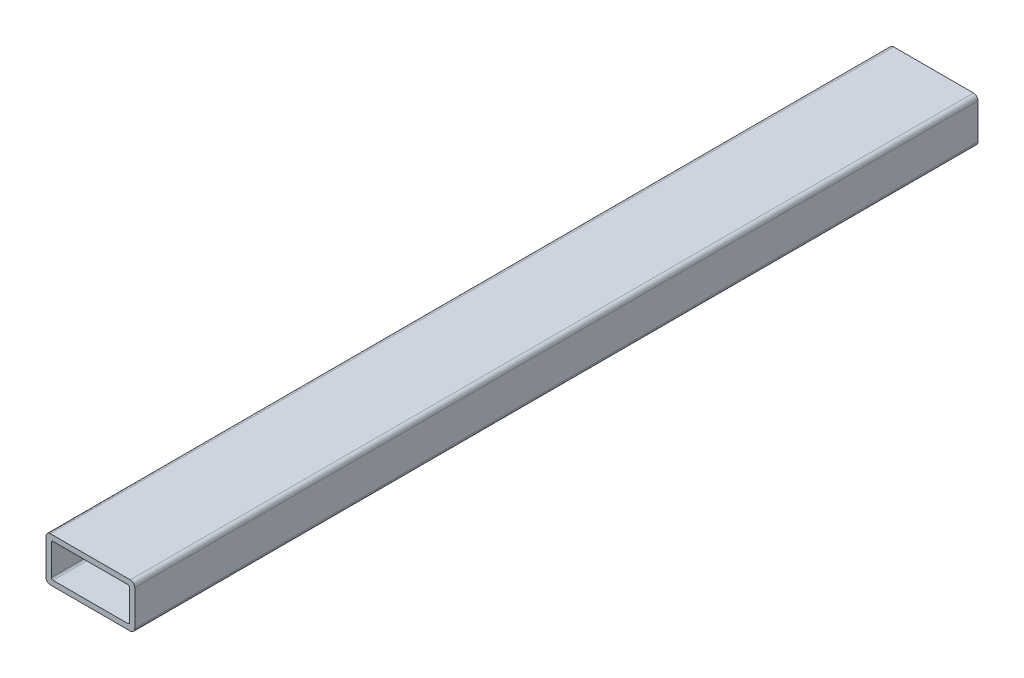
ISO-10303-21;
HEADER;
FILE_DESCRIPTION(('STEP AP214'),'2;1');
FILE_NAME('part.step','',(''),(''),'','','');
FILE_SCHEMA(('AUTOMOTIVE_DESIGN { 1 0 10303 214 1 1 1 1 }'));
ENDSEC;
DATA;
#1=APPLICATION_CONTEXT('core data for automotive mechanical design processes');
#2=APPLICATION_PROTOCOL_DEFINITION('international standard','automotive_design',2000,#1);
#3=PRODUCT_CONTEXT('',#1,'mechanical');
#4=PRODUCT('Part','Part','',(#3));
#5=PRODUCT_RELATED_PRODUCT_CATEGORY('part','',(#4));
#6=PRODUCT_DEFINITION_FORMATION('','',#4);
#7=PRODUCT_DEFINITION_CONTEXT('part definition',#1,'design');
#8=PRODUCT_DEFINITION('design','',#6,#7);
#9=PRODUCT_DEFINITION_SHAPE('','',#8);
#10=(LENGTH_UNIT() NAMED_UNIT(*) SI_UNIT(.MILLI.,.METRE.));
#11=(NAMED_UNIT(*) PLANE_ANGLE_UNIT() SI_UNIT($,.RADIAN.));
#12=(NAMED_UNIT(*) SI_UNIT($,.STERADIAN.) SOLID_ANGLE_UNIT());
#13=UNCERTAINTY_MEASURE_WITH_UNIT(LENGTH_MEASURE(1.E-05),#10,'distance_accuracy_value','');
#14=(GEOMETRIC_REPRESENTATION_CONTEXT(3) GLOBAL_UNCERTAINTY_ASSIGNED_CONTEXT((#13)) GLOBAL_UNIT_ASSIGNED_CONTEXT((#10,
#11,#12)) REPRESENTATION_CONTEXT('',''));
#15=CARTESIAN_POINT('',(0.,0.,0.));
#16=DIRECTION('',(0.,0.,1.));
#17=DIRECTION('',(1.,0.,0.));
#18=AXIS2_PLACEMENT_3D('',#15,#16,#17);
#19=CARTESIAN_POINT('',(22.86,-10.16,482.6));
#20=DIRECTION('',(0.,0.,1.));
#21=DIRECTION('',(1.,0.,0.));
#22=AXIS2_PLACEMENT_3D('',#19,#20,#21);
#23=PLANE('',#22);
#24=CARTESIAN_POINT('',(22.86,-10.16,482.6));
#25=DIRECTION('',(0.,0.,1.));
#26=DIRECTION('',(1.,0.,0.));
#27=AXIS2_PLACEMENT_3D('',#24,#25,#26);
#28=CIRCLE('',#27,2.54);
#29=CARTESIAN_POINT('',(22.86,-12.7,482.6));
#30=VERTEX_POINT('',#29);
#31=CARTESIAN_POINT('',(25.4,-10.16,482.6));
#32=VERTEX_POINT('',#31);
#33=EDGE_CURVE('E244',#30,#32,#28,.T.);
#34=ORIENTED_EDGE('',*,*,#33,.T.);
#35=DIRECTION('',(0.,1.,0.));
#36=VECTOR('',#35,1.);
#37=CARTESIAN_POINT('',(25.4,-10.16,482.6));
#38=LINE('',#37,#36);
#39=CARTESIAN_POINT('',(25.4,10.16,482.6));
#40=VERTEX_POINT('',#39);
#41=EDGE_CURVE('E248',#32,#40,#38,.T.);
#42=ORIENTED_EDGE('',*,*,#41,.T.);
#43=CARTESIAN_POINT('',(22.86,10.16,482.6));
#44=DIRECTION('',(0.,0.,1.));
#45=DIRECTION('',(1.,0.,0.));
#46=AXIS2_PLACEMENT_3D('',#43,#44,#45);
#47=CIRCLE('',#46,2.54);
#48=CARTESIAN_POINT('',(22.86,12.7,482.6));
#49=VERTEX_POINT('',#48);
#50=EDGE_CURVE('E252',#40,#49,#47,.T.);
#51=ORIENTED_EDGE('',*,*,#50,.T.);
#52=DIRECTION('',(-1.,0.,0.));
#53=VECTOR('',#52,1.);
#54=CARTESIAN_POINT('',(22.86,12.7,482.6));
#55=LINE('',#54,#53);
#56=CARTESIAN_POINT('',(-22.86,12.7,482.6));
#57=VERTEX_POINT('',#56);
#58=EDGE_CURVE('E255',#49,#57,#55,.T.);
#59=ORIENTED_EDGE('',*,*,#58,.T.);
#60=CARTESIAN_POINT('',(-22.86,10.16,482.6));
#61=DIRECTION('',(0.,0.,1.));
#62=DIRECTION('',(1.,0.,0.));
#63=AXIS2_PLACEMENT_3D('',#60,#61,#62);
#64=CIRCLE('',#63,2.54);
#65=CARTESIAN_POINT('',(-25.4,10.16,482.6));
#66=VERTEX_POINT('',#65);
#67=EDGE_CURVE('E258',#57,#66,#64,.T.);
#68=ORIENTED_EDGE('',*,*,#67,.T.);
#69=DIRECTION('',(0.,-1.,0.));
#70=VECTOR('',#69,1.);
#71=CARTESIAN_POINT('',(-25.4,-10.16,482.6));
#72=LINE('',#71,#70);
#73=CARTESIAN_POINT('',(-25.4,-10.16,482.6));
#74=VERTEX_POINT('',#73);
#75=EDGE_CURVE('E261',#66,#74,#72,.T.);
#76=ORIENTED_EDGE('',*,*,#75,.T.);
#77=CARTESIAN_POINT('',(-22.86,-10.16,482.6));
#78=DIRECTION('',(0.,0.,1.));
#79=DIRECTION('',(1.,0.,0.));
#80=AXIS2_PLACEMENT_3D('',#77,#78,#79);
#81=CIRCLE('',#80,2.54);
#82=CARTESIAN_POINT('',(-22.86,-12.7,482.6));
#83=VERTEX_POINT('',#82);
#84=EDGE_CURVE('E264',#74,#83,#81,.T.);
#85=ORIENTED_EDGE('',*,*,#84,.T.);
#86=DIRECTION('',(1.,0.,0.));
#87=VECTOR('',#86,1.);
#88=CARTESIAN_POINT('',(22.86,-12.7,482.6));
#89=LINE('',#88,#87);
#90=EDGE_CURVE('E267',#83,#30,#89,.T.);
#91=ORIENTED_EDGE('',*,*,#90,.T.);
#92=EDGE_LOOP('',(#34,#42,#51,#59,#68,#76,#85,#91));
#93=FACE_BOUND('',#92,.T.);
#94=DIRECTION('',(-1.,0.,0.));
#95=VECTOR('',#94,1.);
#96=CARTESIAN_POINT('',(21.3868,9.65199999999999,482.6));
#97=LINE('',#96,#95);
#98=CARTESIAN_POINT('',(21.3868,9.65199999999999,482.6));
#99=VERTEX_POINT('',#98);
#100=CARTESIAN_POINT('',(-21.3868,9.652,482.6));
#101=VERTEX_POINT('',#100);
#102=EDGE_CURVE('E164',#99,#101,#97,.T.);
#103=ORIENTED_EDGE('',*,*,#102,.F.);
#104=CARTESIAN_POINT('',(21.3868,8.6868,482.6));
#105=DIRECTION('',(0.,0.,1.));
#106=DIRECTION('',(1.,0.,0.));
#107=AXIS2_PLACEMENT_3D('',#104,#105,#106);
#108=CIRCLE('',#107,0.965199999999993);
#109=CARTESIAN_POINT('',(22.352,8.68680000000001,482.6));
#110=VERTEX_POINT('',#109);
#111=EDGE_CURVE('E155',#110,#99,#108,.T.);
#112=ORIENTED_EDGE('',*,*,#111,.F.);
#113=DIRECTION('',(0.,1.,0.));
#114=VECTOR('',#113,1.);
#115=CARTESIAN_POINT('',(22.352,8.68680000000001,482.6));
#116=LINE('',#115,#114);
#117=CARTESIAN_POINT('',(22.352,-8.6868,482.6));
#118=VERTEX_POINT('',#117);
#119=EDGE_CURVE('E196',#118,#110,#116,.T.);
#120=ORIENTED_EDGE('',*,*,#119,.F.);
#121=CARTESIAN_POINT('',(21.3868,-8.6868,482.6));
#122=DIRECTION('',(0.,0.,1.));
#123=DIRECTION('',(1.,0.,0.));
#124=AXIS2_PLACEMENT_3D('',#121,#122,#123);
#125=CIRCLE('',#124,0.965199999999999);
#126=CARTESIAN_POINT('',(21.3868,-9.652,482.6));
#127=VERTEX_POINT('',#126);
#128=EDGE_CURVE('E193',#127,#118,#125,.T.);
#129=ORIENTED_EDGE('',*,*,#128,.F.);
#130=DIRECTION('',(1.,0.,0.));
#131=VECTOR('',#130,1.);
#132=CARTESIAN_POINT('',(21.3868,-9.652,482.6));
#133=LINE('',#132,#131);
#134=CARTESIAN_POINT('',(-21.3868,-9.652,482.6));
#135=VERTEX_POINT('',#134);
#136=EDGE_CURVE('E190',#135,#127,#133,.T.);
#137=ORIENTED_EDGE('',*,*,#136,.F.);
#138=CARTESIAN_POINT('',(-21.3868,-8.6868,482.6));
#139=DIRECTION('',(0.,0.,1.));
#140=DIRECTION('',(1.,0.,0.));
#141=AXIS2_PLACEMENT_3D('',#138,#139,#140);
#142=CIRCLE('',#141,0.965199999999999);
#143=CARTESIAN_POINT('',(-22.352,-8.6868,482.6));
#144=VERTEX_POINT('',#143);
#145=EDGE_CURVE('E187',#144,#135,#142,.T.);
#146=ORIENTED_EDGE('',*,*,#145,.F.);
#147=DIRECTION('',(0.,-1.,0.));
#148=VECTOR('',#147,1.);
#149=CARTESIAN_POINT('',(-22.352,8.6868,482.6));
#150=LINE('',#149,#148);
#151=CARTESIAN_POINT('',(-22.352,8.6868,482.6));
#152=VERTEX_POINT('',#151);
#153=EDGE_CURVE('E182',#152,#144,#150,.T.);
#154=ORIENTED_EDGE('',*,*,#153,.F.);
#155=CARTESIAN_POINT('',(-21.3868,8.6868,482.6));
#156=DIRECTION('',(0.,0.,1.));
#157=DIRECTION('',(1.,0.,0.));
#158=AXIS2_PLACEMENT_3D('',#155,#156,#157);
#159=CIRCLE('',#158,0.965199999999999);
#160=EDGE_CURVE('E178',#101,#152,#159,.T.);
#161=ORIENTED_EDGE('',*,*,#160,.F.);
#162=EDGE_LOOP('',(#103,#112,#120,#129,#137,#146,#154,#161));
#163=FACE_BOUND('',#162,.T.);
#164=ADVANCED_FACE('F41',(#93,#163),#23,.T.);
#165=CARTESIAN_POINT('',(22.86,-10.16,0.));
#166=DIRECTION('',(0.,0.,1.));
#167=DIRECTION('',(1.,0.,0.));
#168=AXIS2_PLACEMENT_3D('',#165,#166,#167);
#169=PLANE('',#168);
#170=CARTESIAN_POINT('',(22.86,-10.16,0.));
#171=DIRECTION('',(0.,0.,1.));
#172=DIRECTION('',(1.,0.,0.));
#173=AXIS2_PLACEMENT_3D('',#170,#171,#172);
#174=CIRCLE('',#173,2.54);
#175=CARTESIAN_POINT('',(22.86,-12.7,0.));
#176=VERTEX_POINT('',#175);
#177=CARTESIAN_POINT('',(25.4,-10.16,0.));
#178=VERTEX_POINT('',#177);
#179=EDGE_CURVE('E173',#176,#178,#174,.T.);
#180=ORIENTED_EDGE('',*,*,#179,.F.);
#181=DIRECTION('',(1.,0.,0.));
#182=VECTOR('',#181,1.);
#183=CARTESIAN_POINT('',(22.86,-12.7,0.));
#184=LINE('',#183,#182);
#185=CARTESIAN_POINT('',(-22.86,-12.7,0.));
#186=VERTEX_POINT('',#185);
#187=EDGE_CURVE('E249',#186,#176,#184,.T.);
#188=ORIENTED_EDGE('',*,*,#187,.F.);
#189=CARTESIAN_POINT('',(-22.86,-10.16,0.));
#190=DIRECTION('',(0.,0.,1.));
#191=DIRECTION('',(1.,0.,0.));
#192=AXIS2_PLACEMENT_3D('',#189,#190,#191);
#193=CIRCLE('',#192,2.54);
#194=CARTESIAN_POINT('',(-25.4,-10.16,0.));
#195=VERTEX_POINT('',#194);
#196=EDGE_CURVE('E289',#195,#186,#193,.T.);
#197=ORIENTED_EDGE('',*,*,#196,.F.);
#198=DIRECTION('',(0.,-1.,0.));
#199=VECTOR('',#198,1.);
#200=CARTESIAN_POINT('',(-25.4,-10.16,0.));
#201=LINE('',#200,#199);
#202=CARTESIAN_POINT('',(-25.4,10.16,0.));
#203=VERTEX_POINT('',#202);
#204=EDGE_CURVE('E286',#203,#195,#201,.T.);
#205=ORIENTED_EDGE('',*,*,#204,.F.);
#206=CARTESIAN_POINT('',(-22.86,10.16,0.));
#207=DIRECTION('',(0.,0.,1.));
#208=DIRECTION('',(1.,0.,0.));
#209=AXIS2_PLACEMENT_3D('',#206,#207,#208);
#210=CIRCLE('',#209,2.54);
#211=CARTESIAN_POINT('',(-22.86,12.7,0.));
#212=VERTEX_POINT('',#211);
#213=EDGE_CURVE('E283',#212,#203,#210,.T.);
#214=ORIENTED_EDGE('',*,*,#213,.F.);
#215=DIRECTION('',(-1.,0.,0.));
#216=VECTOR('',#215,1.);
#217=CARTESIAN_POINT('',(22.86,12.7,0.));
#218=LINE('',#217,#216);
#219=CARTESIAN_POINT('',(22.86,12.7,0.));
#220=VERTEX_POINT('',#219);
#221=EDGE_CURVE('E280',#220,#212,#218,.T.);
#222=ORIENTED_EDGE('',*,*,#221,.F.);
#223=CARTESIAN_POINT('',(22.86,10.16,0.));
#224=DIRECTION('',(0.,0.,1.));
#225=DIRECTION('',(1.,0.,0.));
#226=AXIS2_PLACEMENT_3D('',#223,#224,#225);
#227=CIRCLE('',#226,2.54);
#228=CARTESIAN_POINT('',(25.4,10.16,0.));
#229=VERTEX_POINT('',#228);
#230=EDGE_CURVE('E277',#229,#220,#227,.T.);
#231=ORIENTED_EDGE('',*,*,#230,.F.);
#232=DIRECTION('',(0.,1.,0.));
#233=VECTOR('',#232,1.);
#234=CARTESIAN_POINT('',(25.4,-10.16,0.));
#235=LINE('',#234,#233);
#236=EDGE_CURVE('E274',#178,#229,#235,.T.);
#237=ORIENTED_EDGE('',*,*,#236,.F.);
#238=EDGE_LOOP('',(#180,#188,#197,#205,#214,#222,#231,#237));
#239=FACE_BOUND('',#238,.T.);
#240=CARTESIAN_POINT('',(21.3868,8.6868,0.));
#241=DIRECTION('',(0.,0.,1.));
#242=DIRECTION('',(1.,0.,0.));
#243=AXIS2_PLACEMENT_3D('',#240,#241,#242);
#244=CIRCLE('',#243,0.965199999999993);
#245=CARTESIAN_POINT('',(22.352,8.68680000000001,0.));
#246=VERTEX_POINT('',#245);
#247=CARTESIAN_POINT('',(21.3868,9.65199999999999,0.));
#248=VERTEX_POINT('',#247);
#249=EDGE_CURVE('E65',#246,#248,#244,.T.);
#250=ORIENTED_EDGE('',*,*,#249,.T.);
#251=DIRECTION('',(-1.,0.,0.));
#252=VECTOR('',#251,1.);
#253=CARTESIAN_POINT('',(21.3868,9.65199999999999,0.));
#254=LINE('',#253,#252);
#255=CARTESIAN_POINT('',(-21.3868,9.652,0.));
#256=VERTEX_POINT('',#255);
#257=EDGE_CURVE('E171',#248,#256,#254,.T.);
#258=ORIENTED_EDGE('',*,*,#257,.T.);
#259=CARTESIAN_POINT('',(-21.3868,8.6868,0.));
#260=DIRECTION('',(0.,0.,1.));
#261=DIRECTION('',(1.,0.,0.));
#262=AXIS2_PLACEMENT_3D('',#259,#260,#261);
#263=CIRCLE('',#262,0.965199999999999);
#264=CARTESIAN_POINT('',(-22.352,8.6868,0.));
#265=VERTEX_POINT('',#264);
#266=EDGE_CURVE('E203',#256,#265,#263,.T.);
#267=ORIENTED_EDGE('',*,*,#266,.T.);
#268=DIRECTION('',(0.,-1.,0.));
#269=VECTOR('',#268,1.);
#270=CARTESIAN_POINT('',(-22.352,8.6868,0.));
#271=LINE('',#270,#269);
#272=CARTESIAN_POINT('',(-22.352,-8.6868,0.));
#273=VERTEX_POINT('',#272);
#274=EDGE_CURVE('E207',#265,#273,#271,.T.);
#275=ORIENTED_EDGE('',*,*,#274,.T.);
#276=CARTESIAN_POINT('',(-21.3868,-8.6868,0.));
#277=DIRECTION('',(0.,0.,1.));
#278=DIRECTION('',(1.,0.,0.));
#279=AXIS2_PLACEMENT_3D('',#276,#277,#278);
#280=CIRCLE('',#279,0.965199999999999);
#281=CARTESIAN_POINT('',(-21.3868,-9.652,0.));
#282=VERTEX_POINT('',#281);
#283=EDGE_CURVE('E211',#273,#282,#280,.T.);
#284=ORIENTED_EDGE('',*,*,#283,.T.);
#285=DIRECTION('',(1.,0.,0.));
#286=VECTOR('',#285,1.);
#287=CARTESIAN_POINT('',(21.3868,-9.652,0.));
#288=LINE('',#287,#286);
#289=CARTESIAN_POINT('',(21.3868,-9.652,0.));
#290=VERTEX_POINT('',#289);
#291=EDGE_CURVE('E215',#282,#290,#288,.T.);
#292=ORIENTED_EDGE('',*,*,#291,.T.);
#293=CARTESIAN_POINT('',(21.3868,-8.6868,0.));
#294=DIRECTION('',(0.,0.,1.));
#295=DIRECTION('',(1.,0.,0.));
#296=AXIS2_PLACEMENT_3D('',#293,#294,#295);
#297=CIRCLE('',#296,0.965199999999999);
#298=CARTESIAN_POINT('',(22.352,-8.6868,0.));
#299=VERTEX_POINT('',#298);
#300=EDGE_CURVE('E219',#290,#299,#297,.T.);
#301=ORIENTED_EDGE('',*,*,#300,.T.);
#302=DIRECTION('',(0.,1.,0.));
#303=VECTOR('',#302,1.);
#304=CARTESIAN_POINT('',(22.352,8.68680000000001,0.));
#305=LINE('',#304,#303);
#306=EDGE_CURVE('E165',#299,#246,#305,.T.);
#307=ORIENTED_EDGE('',*,*,#306,.T.);
#308=EDGE_LOOP('',(#250,#258,#267,#275,#284,#292,#301,#307));
#309=FACE_BOUND('',#308,.T.);
#310=ADVANCED_FACE('F328',(#239,#309),#169,.F.);
#311=CARTESIAN_POINT('',(22.86,-10.16,482.6));
#312=DIRECTION('',(0.,0.,-1.));
#313=DIRECTION('',(-1.,0.,0.));
#314=AXIS2_PLACEMENT_3D('',#311,#312,#313);
#315=CYLINDRICAL_SURFACE('',#314,2.54);
#316=ORIENTED_EDGE('',*,*,#179,.T.);
#317=DIRECTION('',(0.,0.,-1.));
#318=VECTOR('',#317,1.);
#319=CARTESIAN_POINT('',(25.4,-10.16,482.6));
#320=LINE('',#319,#318);
#321=EDGE_CURVE('E11',#32,#178,#320,.T.);
#322=ORIENTED_EDGE('',*,*,#321,.F.);
#323=ORIENTED_EDGE('',*,*,#33,.F.);
#324=DIRECTION('',(0.,0.,-1.));
#325=VECTOR('',#324,1.);
#326=CARTESIAN_POINT('',(22.86,-12.7,482.6));
#327=LINE('',#326,#325);
#328=EDGE_CURVE('E270',#30,#176,#327,.T.);
#329=ORIENTED_EDGE('',*,*,#328,.T.);
#330=EDGE_LOOP('',(#316,#322,#323,#329));
#331=FACE_BOUND('',#330,.T.);
#332=ADVANCED_FACE('F43',(#331),#315,.T.);
#333=CARTESIAN_POINT('',(25.4,-10.16,482.6));
#334=DIRECTION('',(-1.,0.,0.));
#335=DIRECTION('',(0.,0.,1.));
#336=AXIS2_PLACEMENT_3D('',#333,#334,#335);
#337=PLANE('',#336);
#338=ORIENTED_EDGE('',*,*,#236,.T.);
#339=DIRECTION('',(0.,0.,-1.));
#340=VECTOR('',#339,1.);
#341=CARTESIAN_POINT('',(25.4,10.16,482.6));
#342=LINE('',#341,#340);
#343=EDGE_CURVE('E50',#40,#229,#342,.T.);
#344=ORIENTED_EDGE('',*,*,#343,.F.);
#345=ORIENTED_EDGE('',*,*,#41,.F.);
#346=ORIENTED_EDGE('',*,*,#321,.T.);
#347=EDGE_LOOP('',(#338,#344,#345,#346));
#348=FACE_BOUND('',#347,.T.);
#349=ADVANCED_FACE('F345',(#348),#337,.F.);
#350=CARTESIAN_POINT('',(22.86,10.16,482.6));
#351=DIRECTION('',(0.,0.,-1.));
#352=DIRECTION('',(-1.,0.,0.));
#353=AXIS2_PLACEMENT_3D('',#350,#351,#352);
#354=CYLINDRICAL_SURFACE('',#353,2.54);
#355=ORIENTED_EDGE('',*,*,#230,.T.);
#356=DIRECTION('',(0.,0.,-1.));
#357=VECTOR('',#356,1.);
#358=CARTESIAN_POINT('',(22.86,12.7,482.6));
#359=LINE('',#358,#357);
#360=EDGE_CURVE('E313',#49,#220,#359,.T.);
#361=ORIENTED_EDGE('',*,*,#360,.F.);
#362=ORIENTED_EDGE('',*,*,#50,.F.);
#363=ORIENTED_EDGE('',*,*,#343,.T.);
#364=EDGE_LOOP('',(#355,#361,#362,#363));
#365=FACE_BOUND('',#364,.T.);
#366=ADVANCED_FACE('F322',(#365),#354,.T.);
#367=CARTESIAN_POINT('',(22.86,12.7,482.6));
#368=DIRECTION('',(0.,-1.,0.));
#369=DIRECTION('',(0.,0.,-1.));
#370=AXIS2_PLACEMENT_3D('',#367,#368,#369);
#371=PLANE('',#370);
#372=ORIENTED_EDGE('',*,*,#221,.T.);
#373=DIRECTION('',(0.,0.,-1.));
#374=VECTOR('',#373,1.);
#375=CARTESIAN_POINT('',(-22.86,12.7,482.6));
#376=LINE('',#375,#374);
#377=EDGE_CURVE('E309',#57,#212,#376,.T.);
#378=ORIENTED_EDGE('',*,*,#377,.F.);
#379=ORIENTED_EDGE('',*,*,#58,.F.);
#380=ORIENTED_EDGE('',*,*,#360,.T.);
#381=EDGE_LOOP('',(#372,#378,#379,#380));
#382=FACE_BOUND('',#381,.T.);
#383=ADVANCED_FACE('F334',(#382),#371,.F.);
#384=CARTESIAN_POINT('',(-22.86,10.16,482.6));
#385=DIRECTION('',(0.,0.,-1.));
#386=DIRECTION('',(-1.,0.,0.));
#387=AXIS2_PLACEMENT_3D('',#384,#385,#386);
#388=CYLINDRICAL_SURFACE('',#387,2.54);
#389=ORIENTED_EDGE('',*,*,#213,.T.);
#390=DIRECTION('',(0.,0.,-1.));
#391=VECTOR('',#390,1.);
#392=CARTESIAN_POINT('',(-25.4,10.16,482.6));
#393=LINE('',#392,#391);
#394=EDGE_CURVE('E305',#66,#203,#393,.T.);
#395=ORIENTED_EDGE('',*,*,#394,.F.);
#396=ORIENTED_EDGE('',*,*,#67,.F.);
#397=ORIENTED_EDGE('',*,*,#377,.T.);
#398=EDGE_LOOP('',(#389,#395,#396,#397));
#399=FACE_BOUND('',#398,.T.);
#400=ADVANCED_FACE('F338',(#399),#388,.T.);
#401=CARTESIAN_POINT('',(-25.4,-10.16,482.6));
#402=DIRECTION('',(1.,0.,0.));
#403=DIRECTION('',(0.,0.,-1.));
#404=AXIS2_PLACEMENT_3D('',#401,#402,#403);
#405=PLANE('',#404);
#406=ORIENTED_EDGE('',*,*,#204,.T.);
#407=DIRECTION('',(0.,0.,-1.));
#408=VECTOR('',#407,1.);
#409=CARTESIAN_POINT('',(-25.4,-10.16,482.6));
#410=LINE('',#409,#408);
#411=EDGE_CURVE('E301',#74,#195,#410,.T.);
#412=ORIENTED_EDGE('',*,*,#411,.F.);
#413=ORIENTED_EDGE('',*,*,#75,.F.);
#414=ORIENTED_EDGE('',*,*,#394,.T.);
#415=EDGE_LOOP('',(#406,#412,#413,#414));
#416=FACE_BOUND('',#415,.T.);
#417=ADVANCED_FACE('F358',(#416),#405,.F.);
#418=CARTESIAN_POINT('',(-22.86,-10.16,482.6));
#419=DIRECTION('',(0.,0.,-1.));
#420=DIRECTION('',(-1.,0.,0.));
#421=AXIS2_PLACEMENT_3D('',#418,#419,#420);
#422=CYLINDRICAL_SURFACE('',#421,2.54);
#423=ORIENTED_EDGE('',*,*,#196,.T.);
#424=DIRECTION('',(0.,0.,-1.));
#425=VECTOR('',#424,1.);
#426=CARTESIAN_POINT('',(-22.86,-12.7,482.6));
#427=LINE('',#426,#425);
#428=EDGE_CURVE('E297',#83,#186,#427,.T.);
#429=ORIENTED_EDGE('',*,*,#428,.F.);
#430=ORIENTED_EDGE('',*,*,#84,.F.);
#431=ORIENTED_EDGE('',*,*,#411,.T.);
#432=EDGE_LOOP('',(#423,#429,#430,#431));
#433=FACE_BOUND('',#432,.T.);
#434=ADVANCED_FACE('F356',(#433),#422,.T.);
#435=CARTESIAN_POINT('',(22.86,-12.7,482.6));
#436=DIRECTION('',(0.,1.,0.));
#437=DIRECTION('',(0.,0.,1.));
#438=AXIS2_PLACEMENT_3D('',#435,#436,#437);
#439=PLANE('',#438);
#440=ORIENTED_EDGE('',*,*,#187,.T.);
#441=ORIENTED_EDGE('',*,*,#328,.F.);
#442=ORIENTED_EDGE('',*,*,#90,.F.);
#443=ORIENTED_EDGE('',*,*,#428,.T.);
#444=EDGE_LOOP('',(#440,#441,#442,#443));
#445=FACE_BOUND('',#444,.T.);
#446=ADVANCED_FACE('F351',(#445),#439,.F.);
#447=CARTESIAN_POINT('',(21.3868,8.6868,482.6));
#448=DIRECTION('',(0.,0.,-1.));
#449=DIRECTION('',(-1.,0.,0.));
#450=AXIS2_PLACEMENT_3D('',#447,#448,#449);
#451=CYLINDRICAL_SURFACE('',#450,0.965199999999993);
#452=ORIENTED_EDGE('',*,*,#249,.F.);
#453=DIRECTION('',(0.,0.,-1.));
#454=VECTOR('',#453,1.);
#455=CARTESIAN_POINT('',(22.352,8.68680000000001,482.6));
#456=LINE('',#455,#454);
#457=EDGE_CURVE('E159',#110,#246,#456,.T.);
#458=ORIENTED_EDGE('',*,*,#457,.F.);
#459=ORIENTED_EDGE('',*,*,#111,.T.);
#460=DIRECTION('',(0.,0.,-1.));
#461=VECTOR('',#460,1.);
#462=CARTESIAN_POINT('',(21.3868,9.65199999999999,482.6));
#463=LINE('',#462,#461);
#464=EDGE_CURVE('E158',#99,#248,#463,.T.);
#465=ORIENTED_EDGE('',*,*,#464,.T.);
#466=EDGE_LOOP('',(#452,#458,#459,#465));
#467=FACE_BOUND('',#466,.T.);
#468=ADVANCED_FACE('F157',(#467),#451,.F.);
#469=CARTESIAN_POINT('',(21.3868,9.65199999999999,482.6));
#470=DIRECTION('',(0.,-1.,0.));
#471=DIRECTION('',(1.,0.,0.));
#472=AXIS2_PLACEMENT_3D('',#469,#470,#471);
#473=PLANE('',#472);
#474=ORIENTED_EDGE('',*,*,#257,.F.);
#475=ORIENTED_EDGE('',*,*,#464,.F.);
#476=ORIENTED_EDGE('',*,*,#102,.T.);
#477=DIRECTION('',(0.,0.,-1.));
#478=VECTOR('',#477,1.);
#479=CARTESIAN_POINT('',(-21.3868,9.652,482.6));
#480=LINE('',#479,#478);
#481=EDGE_CURVE('E174',#101,#256,#480,.T.);
#482=ORIENTED_EDGE('',*,*,#481,.T.);
#483=EDGE_LOOP('',(#474,#475,#476,#482));
#484=FACE_BOUND('',#483,.T.);
#485=ADVANCED_FACE('F168',(#484),#473,.T.);
#486=CARTESIAN_POINT('',(-21.3868,8.6868,482.6));
#487=DIRECTION('',(0.,0.,-1.));
#488=DIRECTION('',(-1.,0.,0.));
#489=AXIS2_PLACEMENT_3D('',#486,#487,#488);
#490=CYLINDRICAL_SURFACE('',#489,0.965199999999999);
#491=ORIENTED_EDGE('',*,*,#266,.F.);
#492=ORIENTED_EDGE('',*,*,#481,.F.);
#493=ORIENTED_EDGE('',*,*,#160,.T.);
#494=DIRECTION('',(0.,0.,-1.));
#495=VECTOR('',#494,1.);
#496=CARTESIAN_POINT('',(-22.352,8.6868,482.6));
#497=LINE('',#496,#495);
#498=EDGE_CURVE('E239',#152,#265,#497,.T.);
#499=ORIENTED_EDGE('',*,*,#498,.T.);
#500=EDGE_LOOP('',(#491,#492,#493,#499));
#501=FACE_BOUND('',#500,.T.);
#502=ADVANCED_FACE('F383',(#501),#490,.F.);
#503=CARTESIAN_POINT('',(-22.352,8.6868,482.6));
#504=DIRECTION('',(1.,0.,0.));
#505=DIRECTION('',(0.,0.,-1.));
#506=AXIS2_PLACEMENT_3D('',#503,#504,#505);
#507=PLANE('',#506);
#508=ORIENTED_EDGE('',*,*,#274,.F.);
#509=ORIENTED_EDGE('',*,*,#498,.F.);
#510=ORIENTED_EDGE('',*,*,#153,.T.);
#511=DIRECTION('',(0.,0.,-1.));
#512=VECTOR('',#511,1.);
#513=CARTESIAN_POINT('',(-22.352,-8.6868,482.6));
#514=LINE('',#513,#512);
#515=EDGE_CURVE('E236',#144,#273,#514,.T.);
#516=ORIENTED_EDGE('',*,*,#515,.T.);
#517=EDGE_LOOP('',(#508,#509,#510,#516));
#518=FACE_BOUND('',#517,.T.);
#519=ADVANCED_FACE('F387',(#518),#507,.T.);
#520=CARTESIAN_POINT('',(-21.3868,-8.6868,482.6));
#521=DIRECTION('',(0.,0.,-1.));
#522=DIRECTION('',(-1.,0.,0.));
#523=AXIS2_PLACEMENT_3D('',#520,#521,#522);
#524=CYLINDRICAL_SURFACE('',#523,0.965199999999999);
#525=ORIENTED_EDGE('',*,*,#283,.F.);
#526=ORIENTED_EDGE('',*,*,#515,.F.);
#527=ORIENTED_EDGE('',*,*,#145,.T.);
#528=DIRECTION('',(0.,0.,-1.));
#529=VECTOR('',#528,1.);
#530=CARTESIAN_POINT('',(-21.3868,-9.652,482.6));
#531=LINE('',#530,#529);
#532=EDGE_CURVE('E233',#135,#282,#531,.T.);
#533=ORIENTED_EDGE('',*,*,#532,.T.);
#534=EDGE_LOOP('',(#525,#526,#527,#533));
#535=FACE_BOUND('',#534,.T.);
#536=ADVANCED_FACE('F393',(#535),#524,.F.);
#537=CARTESIAN_POINT('',(21.3868,-9.652,482.6));
#538=DIRECTION('',(0.,1.,0.));
#539=DIRECTION('',(-1.,0.,0.));
#540=AXIS2_PLACEMENT_3D('',#537,#538,#539);
#541=PLANE('',#540);
#542=ORIENTED_EDGE('',*,*,#291,.F.);
#543=ORIENTED_EDGE('',*,*,#532,.F.);
#544=ORIENTED_EDGE('',*,*,#136,.T.);
#545=DIRECTION('',(0.,0.,-1.));
#546=VECTOR('',#545,1.);
#547=CARTESIAN_POINT('',(21.3868,-9.652,482.6));
#548=LINE('',#547,#546);
#549=EDGE_CURVE('E230',#127,#290,#548,.T.);
#550=ORIENTED_EDGE('',*,*,#549,.T.);
#551=EDGE_LOOP('',(#542,#543,#544,#550));
#552=FACE_BOUND('',#551,.T.);
#553=ADVANCED_FACE('F397',(#552),#541,.T.);
#554=CARTESIAN_POINT('',(21.3868,-8.6868,482.6));
#555=DIRECTION('',(0.,0.,-1.));
#556=DIRECTION('',(-1.,0.,0.));
#557=AXIS2_PLACEMENT_3D('',#554,#555,#556);
#558=CYLINDRICAL_SURFACE('',#557,0.965199999999999);
#559=ORIENTED_EDGE('',*,*,#300,.F.);
#560=ORIENTED_EDGE('',*,*,#549,.F.);
#561=ORIENTED_EDGE('',*,*,#128,.T.);
#562=DIRECTION('',(0.,0.,-1.));
#563=VECTOR('',#562,1.);
#564=CARTESIAN_POINT('',(22.352,-8.6868,482.6));
#565=LINE('',#564,#563);
#566=EDGE_CURVE('E57',#118,#299,#565,.T.);
#567=ORIENTED_EDGE('',*,*,#566,.T.);
#568=EDGE_LOOP('',(#559,#560,#561,#567));
#569=FACE_BOUND('',#568,.T.);
#570=ADVANCED_FACE('F401',(#569),#558,.F.);
#571=CARTESIAN_POINT('',(22.352,8.68680000000001,482.6));
#572=DIRECTION('',(-1.,0.,0.));
#573=DIRECTION('',(0.,-1.,0.));
#574=AXIS2_PLACEMENT_3D('',#571,#572,#573);
#575=PLANE('',#574);
#576=ORIENTED_EDGE('',*,*,#306,.F.);
#577=ORIENTED_EDGE('',*,*,#566,.F.);
#578=ORIENTED_EDGE('',*,*,#119,.T.);
#579=ORIENTED_EDGE('',*,*,#457,.T.);
#580=EDGE_LOOP('',(#576,#577,#578,#579));
#581=FACE_BOUND('',#580,.T.);
#582=ADVANCED_FACE('F405',(#581),#575,.T.);
#583=CLOSED_SHELL('',(#164,#310,#332,#349,#366,#383,#400,#417,#434,#446,#468,#485,#502,#519,
#536,#553,#570,#582));
#584=MANIFOLD_SOLID_BREP('B2',#583);
#585=ADVANCED_BREP_SHAPE_REPRESENTATION('',(#18,#584),#14);
#586=SHAPE_DEFINITION_REPRESENTATION(#9,#585);
ENDSEC;
END-ISO-10303-21;
